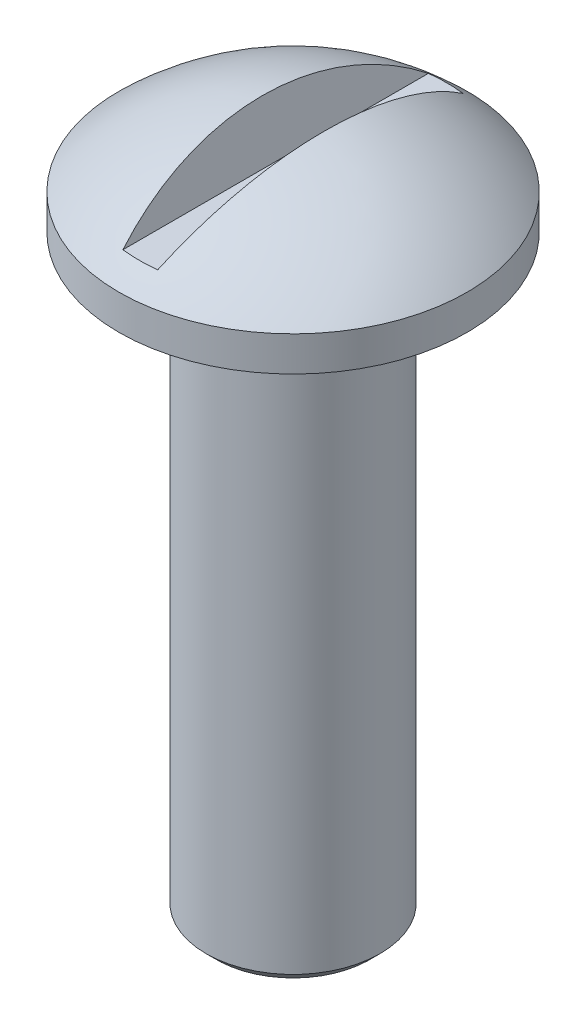
ISO-10303-21;
HEADER;
FILE_DESCRIPTION(('STEP AP214'),'2;1');
FILE_NAME('part.step','',(''),(''),'','','');
FILE_SCHEMA(('AUTOMOTIVE_DESIGN { 1 0 10303 214 1 1 1 1 }'));
ENDSEC;
DATA;
#1=APPLICATION_CONTEXT('core data for automotive mechanical design processes');
#2=APPLICATION_PROTOCOL_DEFINITION('international standard','automotive_design',2000,#1);
#3=PRODUCT_CONTEXT('',#1,'mechanical');
#4=PRODUCT('Part','Part','',(#3));
#5=PRODUCT_RELATED_PRODUCT_CATEGORY('part','',(#4));
#6=PRODUCT_DEFINITION_FORMATION('','',#4);
#7=PRODUCT_DEFINITION_CONTEXT('part definition',#1,'design');
#8=PRODUCT_DEFINITION('design','',#6,#7);
#9=PRODUCT_DEFINITION_SHAPE('','',#8);
#10=(LENGTH_UNIT() NAMED_UNIT(*) SI_UNIT(.MILLI.,.METRE.));
#11=(NAMED_UNIT(*) PLANE_ANGLE_UNIT() SI_UNIT($,.RADIAN.));
#12=(NAMED_UNIT(*) SI_UNIT($,.STERADIAN.) SOLID_ANGLE_UNIT());
#13=UNCERTAINTY_MEASURE_WITH_UNIT(LENGTH_MEASURE(1.E-05),#10,'distance_accuracy_value','');
#14=(GEOMETRIC_REPRESENTATION_CONTEXT(3) GLOBAL_UNCERTAINTY_ASSIGNED_CONTEXT((#13)) GLOBAL_UNIT_ASSIGNED_CONTEXT((#10,
#11,#12)) REPRESENTATION_CONTEXT('',''));
#15=CARTESIAN_POINT('',(0.,0.,0.));
#16=DIRECTION('',(0.,0.,1.));
#17=DIRECTION('',(1.,0.,0.));
#18=AXIS2_PLACEMENT_3D('',#15,#16,#17);
#19=CARTESIAN_POINT('',(0.,-0.525000000000005,0.));
#20=DIRECTION('',(0.,0.,1.));
#21=DIRECTION('',(1.,0.,0.));
#22=AXIS2_PLACEMENT_3D('',#19,#20,#21);
#23=SPHERICAL_SURFACE('',#22,0.725000000000003);
#24=CARTESIAN_POINT('',(0.,0.0499999999999984,0.));
#25=DIRECTION('',(0.,-1.,0.));
#26=DIRECTION('',(0.,0.,-1.));
#27=AXIS2_PLACEMENT_3D('',#24,#25,#26);
#28=CIRCLE('',#27,0.441588043316394);
#29=CARTESIAN_POINT('',(0.05,0.0499999999999984,-0.438748219369607));
#30=VERTEX_POINT('',#29);
#31=CARTESIAN_POINT('',(-0.05,0.0499999999999983,-0.438748219369607));
#32=VERTEX_POINT('',#31);
#33=EDGE_CURVE('E67',#30,#32,#28,.F.);
#34=ORIENTED_EDGE('',*,*,#33,.F.);
#35=CARTESIAN_POINT('',(-0.0970993649053865,-0.498982303588032,0.));
#36=DIRECTION('',(0.96592582628907,-0.258819045102515,0.));
#37=DIRECTION('',(0.258819045102515,0.96592582628907,0.));
#38=AXIS2_PLACEMENT_3D('',#35,#36,#37);
#39=CIRCLE('',#38,0.717997070194851);
#40=CARTESIAN_POINT('',(0.05,0.0499999999999984,0.438748219369607));
#41=VERTEX_POINT('',#40);
#42=EDGE_CURVE('E50',#41,#30,#39,.F.);
#43=ORIENTED_EDGE('',*,*,#42,.F.);
#44=CARTESIAN_POINT('',(-0.05,0.0499999999999983,0.438748219369607));
#45=VERTEX_POINT('',#44);
#46=EDGE_CURVE('E59',#45,#41,#28,.F.);
#47=ORIENTED_EDGE('',*,*,#46,.F.);
#48=CARTESIAN_POINT('',(0.0970993649053865,-0.498982303588032,0.));
#49=DIRECTION('',(-0.96592582628907,-0.258819045102515,0.));
#50=DIRECTION('',(0.258819045102515,-0.96592582628907,0.));
#51=AXIS2_PLACEMENT_3D('',#48,#49,#50);
#52=CIRCLE('',#51,0.717997070194851);
#53=EDGE_CURVE('E62',#32,#45,#52,.F.);
#54=ORIENTED_EDGE('',*,*,#53,.F.);
#55=EDGE_LOOP('',(#34,#43,#47,#54));
#56=FACE_BOUND('',#55,.T.);
#57=CARTESIAN_POINT('',(0.,0.,0.));
#58=DIRECTION('',(0.,1.,0.));
#59=DIRECTION('',(0.,0.,1.));
#60=AXIS2_PLACEMENT_3D('',#57,#58,#59);
#61=CIRCLE('',#60,0.5);
#62=CARTESIAN_POINT('',(0.,0.,0.5));
#63=VERTEX_POINT('',#62);
#64=EDGE_CURVE('E73',#63,#63,#61,.T.);
#65=ORIENTED_EDGE('',*,*,#64,.T.);
#66=EDGE_LOOP('',(#65));
#67=FACE_BOUND('',#66,.T.);
#68=ADVANCED_FACE('F35',(#56,#67),#23,.T.);
#69=CARTESIAN_POINT('',(0.,0.341610834886398,0.));
#70=DIRECTION('',(0.,1.,0.));
#71=DIRECTION('',(0.,0.,1.));
#72=AXIS2_PLACEMENT_3D('',#69,#70,#71);
#73=CYLINDRICAL_SURFACE('',#72,0.5);
#74=CARTESIAN_POINT('',(0.,-0.100000000000001,0.));
#75=DIRECTION('',(0.,1.,0.));
#76=DIRECTION('',(0.,0.,1.));
#77=AXIS2_PLACEMENT_3D('',#74,#75,#76);
#78=CIRCLE('',#77,0.500000000000001);
#79=CARTESIAN_POINT('',(0.,-0.100000000000001,0.500000000000001));
#80=VERTEX_POINT('',#79);
#81=EDGE_CURVE('E83',#80,#80,#78,.T.);
#82=ORIENTED_EDGE('',*,*,#81,.T.);
#83=EDGE_LOOP('',(#82));
#84=FACE_BOUND('',#83,.T.);
#85=ORIENTED_EDGE('',*,*,#64,.F.);
#86=EDGE_LOOP('',(#85));
#87=FACE_BOUND('',#86,.T.);
#88=ADVANCED_FACE('F102',(#84,#87),#73,.T.);
#89=CARTESIAN_POINT('',(-0.500000000000001,-0.100000000000001,0.));
#90=DIRECTION('',(0.,-1.,0.));
#91=DIRECTION('',(0.,0.,-1.));
#92=AXIS2_PLACEMENT_3D('',#89,#90,#91);
#93=PLANE('',#92);
#94=CARTESIAN_POINT('',(0.,-0.100000000000001,0.));
#95=DIRECTION('',(0.,1.,0.));
#96=DIRECTION('',(0.,0.,1.));
#97=AXIS2_PLACEMENT_3D('',#94,#95,#96);
#98=CIRCLE('',#97,0.25);
#99=CARTESIAN_POINT('',(0.,-0.100000000000001,0.25));
#100=VERTEX_POINT('',#99);
#101=EDGE_CURVE('E78',#100,#100,#98,.T.);
#102=ORIENTED_EDGE('',*,*,#101,.T.);
#103=EDGE_LOOP('',(#102));
#104=FACE_BOUND('',#103,.T.);
#105=ORIENTED_EDGE('',*,*,#81,.F.);
#106=EDGE_LOOP('',(#105));
#107=FACE_BOUND('',#106,.T.);
#108=ADVANCED_FACE('F106',(#104,#107),#93,.T.);
#109=CARTESIAN_POINT('',(0.,0.341610834886398,0.));
#110=DIRECTION('',(0.,1.,0.));
#111=DIRECTION('',(0.,0.,1.));
#112=AXIS2_PLACEMENT_3D('',#109,#110,#111);
#113=CYLINDRICAL_SURFACE('',#112,0.25);
#114=CARTESIAN_POINT('',(0.,-1.77,0.));
#115=DIRECTION('',(0.,-1.,0.));
#116=DIRECTION('',(0.,0.,-1.));
#117=AXIS2_PLACEMENT_3D('',#114,#115,#116);
#118=CIRCLE('',#117,0.25);
#119=CARTESIAN_POINT('',(0.,-1.77,-0.25));
#120=VERTEX_POINT('',#119);
#121=EDGE_CURVE('E43',#120,#120,#118,.F.);
#122=ORIENTED_EDGE('',*,*,#121,.T.);
#123=EDGE_LOOP('',(#122));
#124=FACE_BOUND('',#123,.T.);
#125=ORIENTED_EDGE('',*,*,#101,.F.);
#126=EDGE_LOOP('',(#125));
#127=FACE_BOUND('',#126,.T.);
#128=ADVANCED_FACE('F91',(#124,#127),#113,.T.);
#129=CARTESIAN_POINT('',(-0.25,-1.8,0.));
#130=DIRECTION('',(0.,-1.,0.));
#131=DIRECTION('',(0.,0.,-1.));
#132=AXIS2_PLACEMENT_3D('',#129,#130,#131);
#133=PLANE('',#132);
#134=CARTESIAN_POINT('',(0.,-1.8,0.));
#135=DIRECTION('',(0.,-1.,0.));
#136=DIRECTION('',(0.,0.,-1.));
#137=AXIS2_PLACEMENT_3D('',#134,#135,#136);
#138=CIRCLE('',#137,0.220000000000001);
#139=CARTESIAN_POINT('',(0.,-1.8,-0.220000000000001));
#140=VERTEX_POINT('',#139);
#141=EDGE_CURVE('E11',#140,#140,#138,.T.);
#142=ORIENTED_EDGE('',*,*,#141,.T.);
#143=EDGE_LOOP('',(#142));
#144=FACE_BOUND('',#143,.T.);
#145=ADVANCED_FACE('F115',(#144),#133,.T.);
#146=CARTESIAN_POINT('',(0.05,0.0499999999999984,3.68686217847897));
#147=DIRECTION('',(0.96592582628907,-0.258819045102515,0.));
#148=DIRECTION('',(0.258819045102515,0.96592582628907,0.));
#149=AXIS2_PLACEMENT_3D('',#146,#147,#148);
#150=PLANE('',#149);
#151=ORIENTED_EDGE('',*,*,#42,.T.);
#152=DIRECTION('',(0.,0.,-1.));
#153=VECTOR('',#152,1.);
#154=CARTESIAN_POINT('',(0.05,0.0499999999999984,3.68686217847897));
#155=LINE('',#154,#153);
#156=EDGE_CURVE('E76',#41,#30,#155,.T.);
#157=ORIENTED_EDGE('',*,*,#156,.F.);
#158=EDGE_LOOP('',(#151,#157));
#159=FACE_BOUND('',#158,.T.);
#160=ADVANCED_FACE('F118',(#159),#150,.F.);
#161=CARTESIAN_POINT('',(0.05,0.0499999999999984,3.68686217847897));
#162=DIRECTION('',(0.,-1.,0.));
#163=DIRECTION('',(0.,0.,-1.));
#164=AXIS2_PLACEMENT_3D('',#161,#162,#163);
#165=PLANE('',#164);
#166=DIRECTION('',(0.,0.,-1.));
#167=VECTOR('',#166,1.);
#168=CARTESIAN_POINT('',(-0.05,0.0499999999999984,3.68686217847897));
#169=LINE('',#168,#167);
#170=EDGE_CURVE('E72',#45,#32,#169,.T.);
#171=ORIENTED_EDGE('',*,*,#170,.F.);
#172=ORIENTED_EDGE('',*,*,#46,.T.);
#173=ORIENTED_EDGE('',*,*,#156,.T.);
#174=ORIENTED_EDGE('',*,*,#33,.T.);
#175=EDGE_LOOP('',(#171,#172,#173,#174));
#176=FACE_BOUND('',#175,.T.);
#177=ADVANCED_FACE('F75',(#176),#165,.F.);
#178=CARTESIAN_POINT('',(-0.05,0.0499999999999984,3.68686217847897));
#179=DIRECTION('',(-0.96592582628907,-0.258819045102515,0.));
#180=DIRECTION('',(0.258819045102515,-0.96592582628907,0.));
#181=AXIS2_PLACEMENT_3D('',#178,#179,#180);
#182=PLANE('',#181);
#183=ORIENTED_EDGE('',*,*,#170,.T.);
#184=ORIENTED_EDGE('',*,*,#53,.T.);
#185=EDGE_LOOP('',(#183,#184));
#186=FACE_BOUND('',#185,.T.);
#187=ADVANCED_FACE('F71',(#186),#182,.F.);
#188=CARTESIAN_POINT('',(0.,-1.77,0.));
#189=DIRECTION('',(0.,1.,0.));
#190=DIRECTION('',(0.,0.,1.));
#191=AXIS2_PLACEMENT_3D('',#188,#189,#190);
#192=CONICAL_SURFACE('',#191,0.25,0.785398163397439);
#193=ORIENTED_EDGE('',*,*,#141,.F.);
#194=EDGE_LOOP('',(#193));
#195=FACE_BOUND('',#194,.T.);
#196=ORIENTED_EDGE('',*,*,#121,.F.);
#197=EDGE_LOOP('',(#196));
#198=FACE_BOUND('',#197,.T.);
#199=ADVANCED_FACE('F37',(#195,#198),#192,.T.);
#200=CLOSED_SHELL('',(#68,#88,#108,#128,#145,#160,#177,#187,#199));
#201=MANIFOLD_SOLID_BREP('B2',#200);
#202=ADVANCED_BREP_SHAPE_REPRESENTATION('',(#18,#201),#14);
#203=SHAPE_DEFINITION_REPRESENTATION(#9,#202);
ENDSEC;
END-ISO-10303-21;
